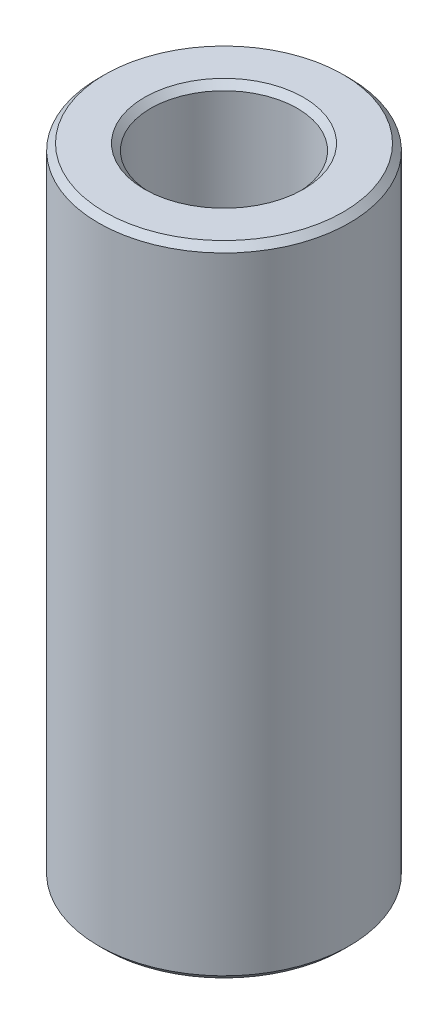
ISO-10303-21;
HEADER;
FILE_DESCRIPTION(('STEP AP214'),'2;1');
FILE_NAME('part.step','',(''),(''),'','','');
FILE_SCHEMA(('AUTOMOTIVE_DESIGN { 1 0 10303 214 1 1 1 1 }'));
ENDSEC;
DATA;
#1=APPLICATION_CONTEXT('core data for automotive mechanical design processes');
#2=APPLICATION_PROTOCOL_DEFINITION('international standard','automotive_design',2000,#1);
#3=PRODUCT_CONTEXT('',#1,'mechanical');
#4=PRODUCT('Part','Part','',(#3));
#5=PRODUCT_RELATED_PRODUCT_CATEGORY('part','',(#4));
#6=PRODUCT_DEFINITION_FORMATION('','',#4);
#7=PRODUCT_DEFINITION_CONTEXT('part definition',#1,'design');
#8=PRODUCT_DEFINITION('design','',#6,#7);
#9=PRODUCT_DEFINITION_SHAPE('','',#8);
#10=(LENGTH_UNIT() NAMED_UNIT(*) SI_UNIT(.MILLI.,.METRE.));
#11=(NAMED_UNIT(*) PLANE_ANGLE_UNIT() SI_UNIT($,.RADIAN.));
#12=(NAMED_UNIT(*) SI_UNIT($,.STERADIAN.) SOLID_ANGLE_UNIT());
#13=UNCERTAINTY_MEASURE_WITH_UNIT(LENGTH_MEASURE(1.E-05),#10,'distance_accuracy_value','');
#14=(GEOMETRIC_REPRESENTATION_CONTEXT(3) GLOBAL_UNCERTAINTY_ASSIGNED_CONTEXT((#13)) GLOBAL_UNIT_ASSIGNED_CONTEXT((#10,
#11,#12)) REPRESENTATION_CONTEXT('',''));
#15=CARTESIAN_POINT('',(0.,0.,0.));
#16=DIRECTION('',(0.,0.,1.));
#17=DIRECTION('',(1.,0.,0.));
#18=AXIS2_PLACEMENT_3D('',#15,#16,#17);
#19=CARTESIAN_POINT('',(0.,190.873743783376,0.));
#20=DIRECTION('',(0.,-1.,0.));
#21=DIRECTION('',(0.,0.,-1.));
#22=AXIS2_PLACEMENT_3D('',#19,#20,#21);
#23=CYLINDRICAL_SURFACE('',#22,37.5);
#24=CARTESIAN_POINT('',(0.,1.88485928290411,0.));
#25=DIRECTION('',(0.,1.,0.));
#26=DIRECTION('',(0.,0.,1.));
#27=AXIS2_PLACEMENT_3D('',#24,#25,#26);
#28=CIRCLE('',#27,37.5);
#29=CARTESIAN_POINT('',(0.,1.88485928290411,-37.5));
#30=VERTEX_POINT('',#29);
#31=EDGE_CURVE('E10',#30,#30,#28,.T.);
#32=CARTESIAN_POINT('',(0.,188.988884500472,0.));
#33=DIRECTION('',(0.,1.,0.));
#34=DIRECTION('',(0.,0.,1.));
#35=AXIS2_PLACEMENT_3D('',#32,#33,#34);
#36=CIRCLE('',#35,37.5);
#37=CARTESIAN_POINT('',(0.,188.988884500472,-37.5));
#38=VERTEX_POINT('',#37);
#39=EDGE_CURVE('E50',#38,#38,#36,.F.);
#40=CARTESIAN_POINT('',(0.,1.88485928290411,-37.5));
#41=CARTESIAN_POINT('',(0.,3.83385954558711,-37.5));
#42=CARTESIAN_POINT('',(0.,5.78285980827011,-37.5));
#43=CARTESIAN_POINT('',(0.,9.68086033363611,-37.5));
#44=CARTESIAN_POINT('',(0.,11.6298605963191,-37.5));
#45=CARTESIAN_POINT('',(0.,15.5278611216851,-37.5));
#46=CARTESIAN_POINT('',(0.,17.4768613843681,-37.5));
#47=CARTESIAN_POINT('',(0.,21.3748619097341,-37.5));
#48=CARTESIAN_POINT('',(0.,23.3238621724171,-37.5));
#49=CARTESIAN_POINT('',(0.,27.2218626977831,-37.5));
#50=CARTESIAN_POINT('',(0.,29.1708629604661,-37.5));
#51=CARTESIAN_POINT('',(0.,33.0688634858321,-37.5));
#52=CARTESIAN_POINT('',(0.,35.0178637485151,-37.5));
#53=CARTESIAN_POINT('',(0.,38.9158642738811,-37.5));
#54=CARTESIAN_POINT('',(0.,40.8648645365641,-37.5));
#55=CARTESIAN_POINT('',(0.,44.7628650619301,-37.5));
#56=CARTESIAN_POINT('',(0.,46.7118653246132,-37.5));
#57=CARTESIAN_POINT('',(0.,50.6098658499792,-37.5));
#58=CARTESIAN_POINT('',(0.,52.5588661126622,-37.5));
#59=CARTESIAN_POINT('',(0.,56.4568666380282,-37.5));
#60=CARTESIAN_POINT('',(0.,58.4058669007112,-37.5));
#61=CARTESIAN_POINT('',(0.,62.3038674260772,-37.5));
#62=CARTESIAN_POINT('',(0.,64.2528676887602,-37.5));
#63=CARTESIAN_POINT('',(0.,68.1508682141262,-37.5));
#64=CARTESIAN_POINT('',(0.,70.0998684768092,-37.5));
#65=CARTESIAN_POINT('',(0.,73.9978690021752,-37.5));
#66=CARTESIAN_POINT('',(0.,75.9468692648582,-37.5));
#67=CARTESIAN_POINT('',(0.,79.8448697902242,-37.5));
#68=CARTESIAN_POINT('',(0.,81.7938700529072,-37.5));
#69=CARTESIAN_POINT('',(0.,85.6918705782732,-37.5));
#70=CARTESIAN_POINT('',(0.,87.6408708409562,-37.5));
#71=CARTESIAN_POINT('',(0.,91.5388713663222,-37.5));
#72=CARTESIAN_POINT('',(0.,93.4878716290052,-37.5));
#73=CARTESIAN_POINT('',(0.,97.3858721543712,-37.5));
#74=CARTESIAN_POINT('',(0.,99.3348724170542,-37.5));
#75=CARTESIAN_POINT('',(0.,103.23287294242,-37.5));
#76=CARTESIAN_POINT('',(0.,105.181873205103,-37.5));
#77=CARTESIAN_POINT('',(0.,109.079873730469,-37.5));
#78=CARTESIAN_POINT('',(0.,111.028873993152,-37.5));
#79=CARTESIAN_POINT('',(0.,114.926874518518,-37.5));
#80=CARTESIAN_POINT('',(0.,116.875874781201,-37.5));
#81=CARTESIAN_POINT('',(0.,120.773875306567,-37.5));
#82=CARTESIAN_POINT('',(0.,122.72287556925,-37.5));
#83=CARTESIAN_POINT('',(0.,126.620876094616,-37.5));
#84=CARTESIAN_POINT('',(0.,128.569876357299,-37.5));
#85=CARTESIAN_POINT('',(0.,132.467876882665,-37.5));
#86=CARTESIAN_POINT('',(0.,134.416877145348,-37.5));
#87=CARTESIAN_POINT('',(0.,138.314877670714,-37.5));
#88=CARTESIAN_POINT('',(0.,140.263877933397,-37.5));
#89=CARTESIAN_POINT('',(0.,144.161878458763,-37.5));
#90=CARTESIAN_POINT('',(0.,146.110878721446,-37.5));
#91=CARTESIAN_POINT('',(0.,150.008879246812,-37.5));
#92=CARTESIAN_POINT('',(0.,151.957879509495,-37.5));
#93=CARTESIAN_POINT('',(0.,155.855880034861,-37.5));
#94=CARTESIAN_POINT('',(0.,157.804880297544,-37.5));
#95=CARTESIAN_POINT('',(0.,161.70288082291,-37.5));
#96=CARTESIAN_POINT('',(0.,163.651881085593,-37.5));
#97=CARTESIAN_POINT('',(0.,167.549881610959,-37.5));
#98=CARTESIAN_POINT('',(0.,169.498881873642,-37.5));
#99=CARTESIAN_POINT('',(0.,173.396882399008,-37.5));
#100=CARTESIAN_POINT('',(0.,175.345882661691,-37.5));
#101=CARTESIAN_POINT('',(0.,179.243883187057,-37.5));
#102=CARTESIAN_POINT('',(0.,181.19288344974,-37.5));
#103=CARTESIAN_POINT('',(0.,185.090883975106,-37.5));
#104=CARTESIAN_POINT('',(0.,187.039884237789,-37.5));
#105=CARTESIAN_POINT('',(0.,188.988884500472,-37.5));
#106=B_SPLINE_CURVE_WITH_KNOTS('',3,(#40,#41,#42,#43,#44,#45,#46,#47,#48,#49,#50,#51,#52,#53,
#54,#55,#56,#57,#58,#59,#60,#61,#62,#63,#64,#65,#66,#67,#68,#69,#70,#71,#72,#73,#74,#75,#76,#77,
#78,#79,#80,#81,#82,#83,#84,#85,#86,#87,#88,#89,#90,#91,#92,#93,#94,#95,#96,#97,#98,#99,#100,
#101,#102,#103,#104,#105),.UNSPECIFIED.,.F.,.F.,(4,2,2,2,2,2,2,2,2,2,2,2,2,2,2,2,2,2,2,2,2,2,2,
2,2,2,2,2,2,2,2,2,4),(0.,5.84700078804901,11.694001576098,17.541002364147,23.388003152196,
29.235003940245,35.082004728294,40.929005516343,46.776006304392,52.6230070924411,
58.4700078804901,64.317008668539,70.1640094565881,76.0110102446371,81.8580110326861,
87.7050118207351,93.5520126087841,99.3990133968331,105.246014184882,111.093014972931,
116.94001576098,122.787016549029,128.634017337078,134.481018125127,140.328018913176,
146.175019701225,152.022020489274,157.869021277323,163.716022065372,169.563022853421,
175.41002364147,181.257024429519,187.104025217568),.UNSPECIFIED.);
#107=EDGE_CURVE('BSEAM39',#30,#38,#106,.T.);
#108=ORIENTED_EDGE('',*,*,#31,.T.);
#109=ORIENTED_EDGE('',*,*,#39,.T.);
#110=ORIENTED_EDGE('',*,*,#107,.T.);
#111=ORIENTED_EDGE('',*,*,#107,.F.);
#112=EDGE_LOOP('',(#108,#110,#109,#111));
#113=FACE_BOUND('',#112,.T.);
#114=ADVANCED_FACE('F39',(#113),#23,.T.);
#115=CARTESIAN_POINT('',(0.,190.873743783376,0.));
#116=DIRECTION('',(0.,1.,0.));
#117=DIRECTION('',(0.,0.,1.));
#118=AXIS2_PLACEMENT_3D('',#115,#116,#117);
#119=PLANE('',#118);
#120=CARTESIAN_POINT('',(0.,190.873743783376,0.));
#121=DIRECTION('',(0.,1.,0.));
#122=DIRECTION('',(0.,0.,1.));
#123=AXIS2_PLACEMENT_3D('',#120,#121,#122);
#124=CIRCLE('',#123,23.7858901284638);
#125=CARTESIAN_POINT('',(0.,190.873743783376,23.7858901284638));
#126=VERTEX_POINT('',#125);
#127=EDGE_CURVE('E58',#126,#126,#124,.F.);
#128=ORIENTED_EDGE('',*,*,#127,.T.);
#129=EDGE_LOOP('',(#128));
#130=FACE_BOUND('',#129,.T.);
#131=CARTESIAN_POINT('',(0.,190.873743783376,0.));
#132=DIRECTION('',(0.,1.,0.));
#133=DIRECTION('',(0.,0.,1.));
#134=AXIS2_PLACEMENT_3D('',#131,#132,#133);
#135=CIRCLE('',#134,35.6151407170961);
#136=CARTESIAN_POINT('',(0.,190.873743783376,-35.6151407170962));
#137=VERTEX_POINT('',#136);
#138=EDGE_CURVE('E61',#137,#137,#135,.T.);
#139=ORIENTED_EDGE('',*,*,#138,.T.);
#140=EDGE_LOOP('',(#139));
#141=FACE_BOUND('',#140,.T.);
#142=ADVANCED_FACE('F88',(#130,#141),#119,.T.);
#143=CARTESIAN_POINT('',(0.,0.,0.));
#144=DIRECTION('',(0.,1.,0.));
#145=DIRECTION('',(0.,0.,1.));
#146=AXIS2_PLACEMENT_3D('',#143,#144,#145);
#147=PLANE('',#146);
#148=CARTESIAN_POINT('',(0.,0.,0.));
#149=DIRECTION('',(0.,1.,0.));
#150=DIRECTION('',(0.,0.,1.));
#151=AXIS2_PLACEMENT_3D('',#148,#149,#150);
#152=CIRCLE('',#151,23.7858901284637);
#153=CARTESIAN_POINT('',(0.,0.,23.7858901284637));
#154=VERTEX_POINT('',#153);
#155=EDGE_CURVE('E51',#154,#154,#152,.T.);
#156=ORIENTED_EDGE('',*,*,#155,.T.);
#157=EDGE_LOOP('',(#156));
#158=FACE_BOUND('',#157,.T.);
#159=CARTESIAN_POINT('',(0.,0.,0.));
#160=DIRECTION('',(0.,1.,0.));
#161=DIRECTION('',(0.,0.,1.));
#162=AXIS2_PLACEMENT_3D('',#159,#160,#161);
#163=CIRCLE('',#162,35.6151407170959);
#164=CARTESIAN_POINT('',(0.,0.,35.6151407170959));
#165=VERTEX_POINT('',#164);
#166=EDGE_CURVE('E54',#165,#165,#163,.F.);
#167=ORIENTED_EDGE('',*,*,#166,.T.);
#168=EDGE_LOOP('',(#167));
#169=FACE_BOUND('',#168,.T.);
#170=ADVANCED_FACE('F83',(#158,#169),#147,.F.);
#171=CARTESIAN_POINT('',(0.,190.873743783376,0.));
#172=DIRECTION('',(0.,-1.,0.));
#173=DIRECTION('',(0.,0.,-1.));
#174=AXIS2_PLACEMENT_3D('',#171,#172,#173);
#175=CYLINDRICAL_SURFACE('',#174,21.9010308455598);
#176=CARTESIAN_POINT('',(0.,188.988884500472,0.));
#177=DIRECTION('',(0.,1.,0.));
#178=DIRECTION('',(0.,0.,1.));
#179=AXIS2_PLACEMENT_3D('',#176,#177,#178);
#180=CIRCLE('',#179,21.9010308455598);
#181=CARTESIAN_POINT('',(0.,188.988884500472,-21.9010308455598));
#182=VERTEX_POINT('',#181);
#183=EDGE_CURVE('E67',#182,#182,#180,.T.);
#184=CARTESIAN_POINT('',(0.,1.88485928290391,0.));
#185=DIRECTION('',(0.,1.,0.));
#186=DIRECTION('',(0.,0.,1.));
#187=AXIS2_PLACEMENT_3D('',#184,#185,#186);
#188=CIRCLE('',#187,21.9010308455598);
#189=CARTESIAN_POINT('',(0.,1.88485928290388,-21.9010308455598));
#190=VERTEX_POINT('',#189);
#191=EDGE_CURVE('E69',#190,#190,#188,.F.);
#192=CARTESIAN_POINT('',(0.,188.988884500472,-21.9010308455598));
#193=CARTESIAN_POINT('',(0.,187.039884237789,-21.9010308455598));
#194=CARTESIAN_POINT('',(0.,185.090883975106,-21.9010308455598));
#195=CARTESIAN_POINT('',(0.,181.19288344974,-21.9010308455598));
#196=CARTESIAN_POINT('',(0.,179.243883187057,-21.9010308455598));
#197=CARTESIAN_POINT('',(0.,175.345882661691,-21.9010308455598));
#198=CARTESIAN_POINT('',(0.,173.396882399008,-21.9010308455598));
#199=CARTESIAN_POINT('',(0.,169.498881873642,-21.9010308455598));
#200=CARTESIAN_POINT('',(0.,167.549881610959,-21.9010308455598));
#201=CARTESIAN_POINT('',(0.,163.651881085593,-21.9010308455598));
#202=CARTESIAN_POINT('',(0.,161.70288082291,-21.9010308455598));
#203=CARTESIAN_POINT('',(0.,157.804880297544,-21.9010308455598));
#204=CARTESIAN_POINT('',(0.,155.855880034861,-21.9010308455598));
#205=CARTESIAN_POINT('',(0.,151.957879509495,-21.9010308455598));
#206=CARTESIAN_POINT('',(0.,150.008879246812,-21.9010308455598));
#207=CARTESIAN_POINT('',(0.,146.110878721446,-21.9010308455598));
#208=CARTESIAN_POINT('',(0.,144.161878458763,-21.9010308455598));
#209=CARTESIAN_POINT('',(0.,140.263877933397,-21.9010308455598));
#210=CARTESIAN_POINT('',(0.,138.314877670714,-21.9010308455598));
#211=CARTESIAN_POINT('',(0.,134.416877145348,-21.9010308455598));
#212=CARTESIAN_POINT('',(0.,132.467876882665,-21.9010308455598));
#213=CARTESIAN_POINT('',(0.,128.569876357299,-21.9010308455598));
#214=CARTESIAN_POINT('',(0.,126.620876094616,-21.9010308455598));
#215=CARTESIAN_POINT('',(0.,122.72287556925,-21.9010308455598));
#216=CARTESIAN_POINT('',(0.,120.773875306567,-21.9010308455598));
#217=CARTESIAN_POINT('',(0.,116.875874781201,-21.9010308455598));
#218=CARTESIAN_POINT('',(0.,114.926874518518,-21.9010308455598));
#219=CARTESIAN_POINT('',(0.,111.028873993152,-21.9010308455598));
#220=CARTESIAN_POINT('',(0.,109.079873730469,-21.9010308455598));
#221=CARTESIAN_POINT('',(0.,105.181873205103,-21.9010308455598));
#222=CARTESIAN_POINT('',(0.,103.23287294242,-21.9010308455598));
#223=CARTESIAN_POINT('',(0.,99.334872417054,-21.9010308455598));
#224=CARTESIAN_POINT('',(0.,97.385872154371,-21.9010308455598));
#225=CARTESIAN_POINT('',(0.,93.487871629005,-21.9010308455598));
#226=CARTESIAN_POINT('',(0.,91.538871366322,-21.9010308455598));
#227=CARTESIAN_POINT('',(0.,87.640870840956,-21.9010308455598));
#228=CARTESIAN_POINT('',(0.,85.691870578273,-21.9010308455598));
#229=CARTESIAN_POINT('',(0.,81.793870052907,-21.9010308455598));
#230=CARTESIAN_POINT('',(0.,79.844869790224,-21.9010308455598));
#231=CARTESIAN_POINT('',(0.,75.946869264858,-21.9010308455598));
#232=CARTESIAN_POINT('',(0.,73.997869002175,-21.9010308455598));
#233=CARTESIAN_POINT('',(0.,70.099868476809,-21.9010308455598));
#234=CARTESIAN_POINT('',(0.,68.150868214126,-21.9010308455598));
#235=CARTESIAN_POINT('',(0.,64.25286768876,-21.9010308455598));
#236=CARTESIAN_POINT('',(0.,62.303867426077,-21.9010308455598));
#237=CARTESIAN_POINT('',(0.,58.405866900711,-21.9010308455598));
#238=CARTESIAN_POINT('',(0.,56.456866638028,-21.9010308455598));
#239=CARTESIAN_POINT('',(0.,52.558866112662,-21.9010308455598));
#240=CARTESIAN_POINT('',(0.,50.6098658499789,-21.9010308455598));
#241=CARTESIAN_POINT('',(0.,46.7118653246129,-21.9010308455598));
#242=CARTESIAN_POINT('',(0.,44.7628650619299,-21.9010308455598));
#243=CARTESIAN_POINT('',(0.,40.8648645365639,-21.9010308455598));
#244=CARTESIAN_POINT('',(0.,38.9158642738809,-21.9010308455598));
#245=CARTESIAN_POINT('',(0.,35.0178637485149,-21.9010308455598));
#246=CARTESIAN_POINT('',(0.,33.0688634858319,-21.9010308455598));
#247=CARTESIAN_POINT('',(0.,29.1708629604659,-21.9010308455598));
#248=CARTESIAN_POINT('',(0.,27.2218626977829,-21.9010308455598));
#249=CARTESIAN_POINT('',(0.,23.3238621724169,-21.9010308455598));
#250=CARTESIAN_POINT('',(0.,21.3748619097339,-21.9010308455598));
#251=CARTESIAN_POINT('',(0.,17.4768613843679,-21.9010308455598));
#252=CARTESIAN_POINT('',(0.,15.5278611216849,-21.9010308455598));
#253=CARTESIAN_POINT('',(0.,11.6298605963189,-21.9010308455598));
#254=CARTESIAN_POINT('',(0.,9.68086033363589,-21.9010308455598));
#255=CARTESIAN_POINT('',(0.,5.78285980826989,-21.9010308455598));
#256=CARTESIAN_POINT('',(0.,3.83385954558689,-21.9010308455598));
#257=CARTESIAN_POINT('',(0.,1.88485928290388,-21.9010308455598));
#258=B_SPLINE_CURVE_WITH_KNOTS('',3,(#192,#193,#194,#195,#196,#197,#198,#199,#200,#201,#202,
#203,#204,#205,#206,#207,#208,#209,#210,#211,#212,#213,#214,#215,#216,#217,#218,#219,#220,#221,
#222,#223,#224,#225,#226,#227,#228,#229,#230,#231,#232,#233,#234,#235,#236,#237,#238,#239,#240,
#241,#242,#243,#244,#245,#246,#247,#248,#249,#250,#251,#252,#253,#254,#255,#256,#257),
.UNSPECIFIED.,.F.,.F.,(4,2,2,2,2,2,2,2,2,2,2,2,2,2,2,2,2,2,2,2,2,2,2,2,2,2,2,2,2,2,2,2,4),(0.,
5.84700078804901,11.694001576098,17.541002364147,23.388003152196,29.235003940245,
35.082004728294,40.929005516343,46.776006304392,52.6230070924411,58.4700078804901,
64.317008668539,70.1640094565881,76.0110102446371,81.8580110326861,87.7050118207351,
93.5520126087841,99.3990133968331,105.246014184882,111.093014972931,116.94001576098,
122.787016549029,128.634017337078,134.481018125127,140.328018913176,146.175019701225,
152.022020489274,157.869021277323,163.716022065372,169.563022853421,175.41002364147,
181.257024429519,187.104025217568),.UNSPECIFIED.);
#259=EDGE_CURVE('BSEAM71',#182,#190,#258,.T.);
#260=ORIENTED_EDGE('',*,*,#183,.T.);
#261=ORIENTED_EDGE('',*,*,#191,.T.);
#262=ORIENTED_EDGE('',*,*,#259,.T.);
#263=ORIENTED_EDGE('',*,*,#259,.F.);
#264=EDGE_LOOP('',(#260,#262,#261,#263));
#265=FACE_BOUND('',#264,.T.);
#266=ADVANCED_FACE('F71',(#265),#175,.F.);
#267=CARTESIAN_POINT('',(0.,188.988884500472,0.));
#268=DIRECTION('',(0.,1.,0.));
#269=DIRECTION('',(0.,0.,1.));
#270=AXIS2_PLACEMENT_3D('',#267,#268,#269);
#271=CONICAL_SURFACE('',#270,21.9010308455598,0.785398163397452);
#272=ORIENTED_EDGE('',*,*,#127,.F.);
#273=EDGE_LOOP('',(#272));
#274=FACE_BOUND('',#273,.T.);
#275=ORIENTED_EDGE('',*,*,#183,.F.);
#276=EDGE_LOOP('',(#275));
#277=FACE_BOUND('',#276,.T.);
#278=ADVANCED_FACE('F77',(#274,#277),#271,.F.);
#279=CARTESIAN_POINT('',(0.,0.,0.));
#280=DIRECTION('',(0.,-1.,0.));
#281=DIRECTION('',(0.,0.,-1.));
#282=AXIS2_PLACEMENT_3D('',#279,#280,#281);
#283=CONICAL_SURFACE('',#282,23.7858901284637,0.785398163397445);
#284=ORIENTED_EDGE('',*,*,#191,.F.);
#285=EDGE_LOOP('',(#284));
#286=FACE_BOUND('',#285,.T.);
#287=ORIENTED_EDGE('',*,*,#155,.F.);
#288=EDGE_LOOP('',(#287));
#289=FACE_BOUND('',#288,.T.);
#290=ADVANCED_FACE('F73',(#286,#289),#283,.F.);
#291=CARTESIAN_POINT('',(0.,1.88485928290411,0.));
#292=DIRECTION('',(0.,1.,0.));
#293=DIRECTION('',(0.,0.,1.));
#294=AXIS2_PLACEMENT_3D('',#291,#292,#293);
#295=CONICAL_SURFACE('',#294,37.5,0.785398163397461);
#296=ORIENTED_EDGE('',*,*,#166,.F.);
#297=EDGE_LOOP('',(#296));
#298=FACE_BOUND('',#297,.T.);
#299=ORIENTED_EDGE('',*,*,#31,.F.);
#300=EDGE_LOOP('',(#299));
#301=FACE_BOUND('',#300,.T.);
#302=ADVANCED_FACE('F76',(#298,#301),#295,.T.);
#303=CARTESIAN_POINT('',(0.,190.873743783376,0.));
#304=DIRECTION('',(0.,-1.,0.));
#305=DIRECTION('',(0.,0.,-1.));
#306=AXIS2_PLACEMENT_3D('',#303,#304,#305);
#307=CONICAL_SURFACE('',#306,35.6151407170961,0.78539816339745);
#308=CARTESIAN_POINT('',(0.,188.988884500472,-37.5));
#309=CARTESIAN_POINT('',(0.,189.008518451336,-37.4803660491364));
#310=CARTESIAN_POINT('',(0.,189.028152402199,-37.4607320982728));
#311=CARTESIAN_POINT('',(0.,189.067420303927,-37.4214641965457));
#312=CARTESIAN_POINT('',(0.,189.08705425479,-37.4018302456821));
#313=CARTESIAN_POINT('',(0.,189.126322156517,-37.3625623439549));
#314=CARTESIAN_POINT('',(0.,189.145956107381,-37.3429283930914));
#315=CARTESIAN_POINT('',(0.,189.185224009108,-37.3036604913642));
#316=CARTESIAN_POINT('',(0.,189.204857959972,-37.2840265405006));
#317=CARTESIAN_POINT('',(0.,189.244125861699,-37.2447586387735));
#318=CARTESIAN_POINT('',(0.,189.263759812562,-37.2251246879099));
#319=CARTESIAN_POINT('',(0.,189.30302771429,-37.1858567861827));
#320=CARTESIAN_POINT('',(0.,189.322661665153,-37.1662228353191));
#321=CARTESIAN_POINT('',(0.,189.36192956688,-37.126954933592));
#322=CARTESIAN_POINT('',(0.,189.381563517744,-37.1073209827284));
#323=CARTESIAN_POINT('',(0.,189.420831419471,-37.0680530810012));
#324=CARTESIAN_POINT('',(0.,189.440465370335,-37.0484191301376));
#325=CARTESIAN_POINT('',(0.,189.479733272062,-37.0091512284105));
#326=CARTESIAN_POINT('',(0.,189.499367222925,-36.9895172775469));
#327=CARTESIAN_POINT('',(0.,189.538635124653,-36.9502493758197));
#328=CARTESIAN_POINT('',(0.,189.558269075516,-36.9306154249561));
#329=CARTESIAN_POINT('',(0.,189.597536977243,-36.891347523229));
#330=CARTESIAN_POINT('',(0.,189.617170928107,-36.8717135723654));
#331=CARTESIAN_POINT('',(0.,189.656438829834,-36.8324456706382));
#332=CARTESIAN_POINT('',(0.,189.676072780698,-36.8128117197747));
#333=CARTESIAN_POINT('',(0.,189.715340682425,-36.7735438180475));
#334=CARTESIAN_POINT('',(0.,189.734974633288,-36.7539098671839));
#335=CARTESIAN_POINT('',(0.,189.774242535016,-36.7146419654567));
#336=CARTESIAN_POINT('',(0.,189.793876485879,-36.6950080145932));
#337=CARTESIAN_POINT('',(0.,189.833144387606,-36.655740112866));
#338=CARTESIAN_POINT('',(0.,189.85277833847,-36.6361061620024));
#339=CARTESIAN_POINT('',(0.,189.892046240197,-36.5968382602753));
#340=CARTESIAN_POINT('',(0.,189.911680191061,-36.5772043094117));
#341=CARTESIAN_POINT('',(0.,189.950948092788,-36.5379364076845));
#342=CARTESIAN_POINT('',(0.,189.970582043651,-36.5183024568209));
#343=CARTESIAN_POINT('',(0.,190.009849945379,-36.4790345550938));
#344=CARTESIAN_POINT('',(0.,190.029483896242,-36.4594006042302));
#345=CARTESIAN_POINT('',(0.,190.068751797969,-36.420132702503));
#346=CARTESIAN_POINT('',(0.,190.088385748833,-36.4004987516394));
#347=CARTESIAN_POINT('',(0.,190.12765365056,-36.3612308499123));
#348=CARTESIAN_POINT('',(0.,190.147287601424,-36.3415968990487));
#349=CARTESIAN_POINT('',(0.,190.186555503151,-36.3023289973215));
#350=CARTESIAN_POINT('',(0.,190.206189454014,-36.2826950464579));
#351=CARTESIAN_POINT('',(0.,190.245457355742,-36.2434271447308));
#352=CARTESIAN_POINT('',(0.,190.265091306605,-36.2237931938672));
#353=CARTESIAN_POINT('',(0.,190.304359208332,-36.18452529214));
#354=CARTESIAN_POINT('',(0.,190.323993159196,-36.1648913412765));
#355=CARTESIAN_POINT('',(0.,190.363261060923,-36.1256234395493));
#356=CARTESIAN_POINT('',(0.,190.382895011787,-36.1059894886857));
#357=CARTESIAN_POINT('',(0.,190.422162913514,-36.0667215869585));
#358=CARTESIAN_POINT('',(0.,190.441796864377,-36.047087636095));
#359=CARTESIAN_POINT('',(0.,190.481064766104,-36.0078197343678));
#360=CARTESIAN_POINT('',(0.,190.500698716968,-35.9881857835042));
#361=CARTESIAN_POINT('',(0.,190.539966618695,-35.948917881777));
#362=CARTESIAN_POINT('',(0.,190.559600569559,-35.9292839309135));
#363=CARTESIAN_POINT('',(0.,190.598868471286,-35.8900160291863));
#364=CARTESIAN_POINT('',(0.,190.61850242215,-35.8703820783227));
#365=CARTESIAN_POINT('',(0.,190.657770323877,-35.8311141765956));
#366=CARTESIAN_POINT('',(0.,190.67740427474,-35.811480225732));
#367=CARTESIAN_POINT('',(0.,190.716672176467,-35.7722123240048));
#368=CARTESIAN_POINT('',(0.,190.736306127331,-35.7525783731412));
#369=CARTESIAN_POINT('',(0.,190.775574029058,-35.7133104714141));
#370=CARTESIAN_POINT('',(0.,190.795207979922,-35.6936765205505));
#371=CARTESIAN_POINT('',(0.,190.834475881649,-35.6544086188233));
#372=CARTESIAN_POINT('',(0.,190.854109832513,-35.6347746679597));
#373=CARTESIAN_POINT('',(0.,190.873743783376,-35.6151407170962));
#374=B_SPLINE_CURVE_WITH_KNOTS('',3,(#308,#309,#310,#311,#312,#313,#314,#315,#316,#317,#318,
#319,#320,#321,#322,#323,#324,#325,#326,#327,#328,#329,#330,#331,#332,#333,#334,#335,#336,#337,
#338,#339,#340,#341,#342,#343,#344,#345,#346,#347,#348,#349,#350,#351,#352,#353,#354,#355,#356,
#357,#358,#359,#360,#361,#362,#363,#364,#365,#366,#367,#368,#369,#370,#371,#372,#373),
.UNSPECIFIED.,.F.,.F.,(4,2,2,2,2,2,2,2,2,2,2,2,2,2,2,2,2,2,2,2,2,2,2,2,2,2,2,2,2,2,2,2,4),(0.,
0.0832997987827368,0.166599597565469,0.249899396348205,0.333199195130942,0.416498993913674,
0.499798792696411,0.583098591479148,0.66639839026188,0.749698189044616,0.832997987827353,
0.916297786610065,0.999597585392802,1.08289738417554,1.16619718295827,1.24949698174101,
1.33279678052374,1.41609657930648,1.49939637808921,1.58269617687194,1.66599597565468,
1.74929577443742,1.83259557322013,1.91589537200287,1.9991951707856,2.08249496956834,
2.16579476835107,2.24909456713381,2.33239436591654,2.41569416469928,2.49899396348202,
2.58229376226475,2.66559356104748),.UNSPECIFIED.);
#375=EDGE_CURVE('BSEAM45',#38,#137,#374,.T.);
#376=ORIENTED_EDGE('',*,*,#39,.F.);
#377=ORIENTED_EDGE('',*,*,#138,.F.);
#378=ORIENTED_EDGE('',*,*,#375,.T.);
#379=ORIENTED_EDGE('',*,*,#375,.F.);
#380=EDGE_LOOP('',(#376,#378,#377,#379));
#381=FACE_BOUND('',#380,.T.);
#382=ADVANCED_FACE('F45',(#381),#307,.T.);
#383=CLOSED_SHELL('',(#114,#142,#170,#266,#278,#290,#302,#382));
#384=MANIFOLD_SOLID_BREP('B2',#383);
#385=ADVANCED_BREP_SHAPE_REPRESENTATION('',(#18,#384),#14);
#386=SHAPE_DEFINITION_REPRESENTATION(#9,#385);
ENDSEC;
END-ISO-10303-21;
